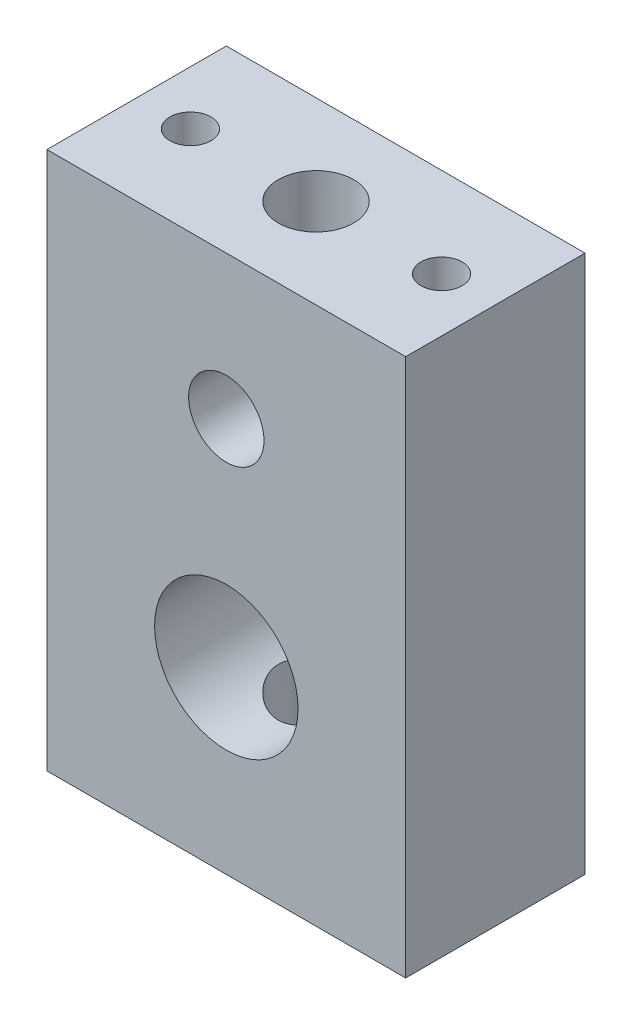
ISO-10303-21;
HEADER;
FILE_DESCRIPTION(('STEP AP214'),'2;1');
FILE_NAME('part.step','',(''),(''),'','','');
FILE_SCHEMA(('AUTOMOTIVE_DESIGN { 1 0 10303 214 1 1 1 1 }'));
ENDSEC;
DATA;
#1=APPLICATION_CONTEXT('core data for automotive mechanical design processes');
#2=APPLICATION_PROTOCOL_DEFINITION('international standard','automotive_design',2000,#1);
#3=PRODUCT_CONTEXT('',#1,'mechanical');
#4=PRODUCT('Part','Part','',(#3));
#5=PRODUCT_RELATED_PRODUCT_CATEGORY('part','',(#4));
#6=PRODUCT_DEFINITION_FORMATION('','',#4);
#7=PRODUCT_DEFINITION_CONTEXT('part definition',#1,'design');
#8=PRODUCT_DEFINITION('design','',#6,#7);
#9=PRODUCT_DEFINITION_SHAPE('','',#8);
#10=(LENGTH_UNIT() NAMED_UNIT(*) SI_UNIT(.MILLI.,.METRE.));
#11=(NAMED_UNIT(*) PLANE_ANGLE_UNIT() SI_UNIT($,.RADIAN.));
#12=(NAMED_UNIT(*) SI_UNIT($,.STERADIAN.) SOLID_ANGLE_UNIT());
#13=UNCERTAINTY_MEASURE_WITH_UNIT(LENGTH_MEASURE(1.E-05),#10,'distance_accuracy_value','');
#14=(GEOMETRIC_REPRESENTATION_CONTEXT(3) GLOBAL_UNCERTAINTY_ASSIGNED_CONTEXT((#13)) GLOBAL_UNIT_ASSIGNED_CONTEXT((#10,
#11,#12)) REPRESENTATION_CONTEXT('',''));
#15=CARTESIAN_POINT('',(0.,0.,0.));
#16=DIRECTION('',(0.,0.,1.));
#17=DIRECTION('',(1.,0.,0.));
#18=AXIS2_PLACEMENT_3D('',#15,#16,#17);
#19=CARTESIAN_POINT('',(10.,22.,10.));
#20=DIRECTION('',(0.,0.,-1.));
#21=DIRECTION('',(-1.,0.,0.));
#22=AXIS2_PLACEMENT_3D('',#19,#20,#21);
#23=CYLINDRICAL_SURFACE('',#22,2.1);
#24=CARTESIAN_POINT('',(10.,22.,5.));
#25=DIRECTION('',(0.,0.707106781186547,-0.707106781186547));
#26=DIRECTION('',(0.,-0.707106781186547,-0.707106781186547));
#27=AXIS2_PLACEMENT_3D('',#24,#25,#26);
#28=ELLIPSE('',#27,2.9698484809835,2.1);
#29=CARTESIAN_POINT('',(12.1,22.,5.));
#30=VERTEX_POINT('',#29);
#31=CARTESIAN_POINT('',(7.9,22.,5.));
#32=VERTEX_POINT('',#31);
#33=EDGE_CURVE('E11',#30,#32,#28,.F.);
#34=ORIENTED_EDGE('',*,*,#33,.F.);
#35=CARTESIAN_POINT('',(10.,22.,5.));
#36=DIRECTION('',(0.,-0.707106781186547,-0.707106781186547));
#37=DIRECTION('',(0.,0.707106781186547,-0.707106781186547));
#38=AXIS2_PLACEMENT_3D('',#35,#36,#37);
#39=ELLIPSE('',#38,2.9698484809835,2.1);
#40=EDGE_CURVE('E48',#32,#30,#39,.F.);
#41=ORIENTED_EDGE('',*,*,#40,.F.);
#42=EDGE_LOOP('',(#34,#41));
#43=FACE_BOUND('',#42,.T.);
#44=CARTESIAN_POINT('',(10.,22.,10.));
#45=DIRECTION('',(0.,0.,1.));
#46=DIRECTION('',(1.,0.,0.));
#47=AXIS2_PLACEMENT_3D('',#44,#45,#46);
#48=CIRCLE('',#47,2.1);
#49=CARTESIAN_POINT('',(12.1,22.,10.));
#50=VERTEX_POINT('',#49);
#51=EDGE_CURVE('E131',#50,#50,#48,.T.);
#52=ORIENTED_EDGE('',*,*,#51,.T.);
#53=EDGE_LOOP('',(#52));
#54=FACE_BOUND('',#53,.T.);
#55=ADVANCED_FACE('F34',(#43,#54),#23,.F.);
#56=CARTESIAN_POINT('',(0.,0.,10.));
#57=DIRECTION('',(0.,0.,-1.));
#58=DIRECTION('',(-1.,0.,0.));
#59=AXIS2_PLACEMENT_3D('',#56,#57,#58);
#60=PLANE('',#59);
#61=CARTESIAN_POINT('',(10.,10.,10.));
#62=DIRECTION('',(0.,0.,1.));
#63=DIRECTION('',(1.,0.,0.));
#64=AXIS2_PLACEMENT_3D('',#61,#62,#63);
#65=CIRCLE('',#64,4.);
#66=CARTESIAN_POINT('',(14.,10.,10.));
#67=VERTEX_POINT('',#66);
#68=EDGE_CURVE('E122',#67,#67,#65,.T.);
#69=ORIENTED_EDGE('',*,*,#68,.F.);
#70=EDGE_LOOP('',(#69));
#71=FACE_BOUND('',#70,.T.);
#72=DIRECTION('',(0.,-1.,0.));
#73=VECTOR('',#72,1.);
#74=CARTESIAN_POINT('',(0.,0.,10.));
#75=LINE('',#74,#73);
#76=CARTESIAN_POINT('',(0.,30.,10.));
#77=VERTEX_POINT('',#76);
#78=CARTESIAN_POINT('',(0.,0.,10.));
#79=VERTEX_POINT('',#78);
#80=EDGE_CURVE('E114',#77,#79,#75,.T.);
#81=ORIENTED_EDGE('',*,*,#80,.T.);
#82=DIRECTION('',(1.,0.,0.));
#83=VECTOR('',#82,1.);
#84=CARTESIAN_POINT('',(0.,0.,10.));
#85=LINE('',#84,#83);
#86=CARTESIAN_POINT('',(20.,0.,10.));
#87=VERTEX_POINT('',#86);
#88=EDGE_CURVE('E86',#79,#87,#85,.T.);
#89=ORIENTED_EDGE('',*,*,#88,.T.);
#90=DIRECTION('',(0.,1.,0.));
#91=VECTOR('',#90,1.);
#92=CARTESIAN_POINT('',(20.,0.,10.));
#93=LINE('',#92,#91);
#94=CARTESIAN_POINT('',(20.,30.,10.));
#95=VERTEX_POINT('',#94);
#96=EDGE_CURVE('E124',#87,#95,#93,.T.);
#97=ORIENTED_EDGE('',*,*,#96,.T.);
#98=DIRECTION('',(-1.,0.,0.));
#99=VECTOR('',#98,1.);
#100=CARTESIAN_POINT('',(0.,30.,10.));
#101=LINE('',#100,#99);
#102=EDGE_CURVE('E57',#95,#77,#101,.T.);
#103=ORIENTED_EDGE('',*,*,#102,.T.);
#104=EDGE_LOOP('',(#81,#89,#97,#103));
#105=FACE_BOUND('',#104,.T.);
#106=ORIENTED_EDGE('',*,*,#51,.F.);
#107=EDGE_LOOP('',(#106));
#108=FACE_BOUND('',#107,.T.);
#109=ADVANCED_FACE('F185',(#71,#105,#108),#60,.F.);
#110=CARTESIAN_POINT('',(0.,0.,0.));
#111=DIRECTION('',(0.,0.,-1.));
#112=DIRECTION('',(-1.,0.,0.));
#113=AXIS2_PLACEMENT_3D('',#110,#111,#112);
#114=PLANE('',#113);
#115=CARTESIAN_POINT('',(10.,10.,0.));
#116=DIRECTION('',(0.,0.,1.));
#117=DIRECTION('',(1.,0.,0.));
#118=AXIS2_PLACEMENT_3D('',#115,#116,#117);
#119=CIRCLE('',#118,4.);
#120=CARTESIAN_POINT('',(14.,10.,0.));
#121=VERTEX_POINT('',#120);
#122=EDGE_CURVE('E128',#121,#121,#119,.T.);
#123=ORIENTED_EDGE('',*,*,#122,.T.);
#124=EDGE_LOOP('',(#123));
#125=FACE_BOUND('',#124,.T.);
#126=DIRECTION('',(0.,-1.,0.));
#127=VECTOR('',#126,1.);
#128=CARTESIAN_POINT('',(0.,0.,0.));
#129=LINE('',#128,#127);
#130=CARTESIAN_POINT('',(0.,30.,0.));
#131=VERTEX_POINT('',#130);
#132=CARTESIAN_POINT('',(0.,0.,0.));
#133=VERTEX_POINT('',#132);
#134=EDGE_CURVE('E119',#131,#133,#129,.T.);
#135=ORIENTED_EDGE('',*,*,#134,.F.);
#136=DIRECTION('',(-1.,0.,0.));
#137=VECTOR('',#136,1.);
#138=CARTESIAN_POINT('',(0.,30.,0.));
#139=LINE('',#138,#137);
#140=CARTESIAN_POINT('',(20.,30.,0.));
#141=VERTEX_POINT('',#140);
#142=EDGE_CURVE('E78',#141,#131,#139,.T.);
#143=ORIENTED_EDGE('',*,*,#142,.F.);
#144=DIRECTION('',(0.,1.,0.));
#145=VECTOR('',#144,1.);
#146=CARTESIAN_POINT('',(20.,0.,0.));
#147=LINE('',#146,#145);
#148=CARTESIAN_POINT('',(20.,0.,0.));
#149=VERTEX_POINT('',#148);
#150=EDGE_CURVE('E115',#149,#141,#147,.T.);
#151=ORIENTED_EDGE('',*,*,#150,.F.);
#152=DIRECTION('',(1.,0.,0.));
#153=VECTOR('',#152,1.);
#154=CARTESIAN_POINT('',(0.,0.,0.));
#155=LINE('',#154,#153);
#156=EDGE_CURVE('E117',#133,#149,#155,.T.);
#157=ORIENTED_EDGE('',*,*,#156,.F.);
#158=EDGE_LOOP('',(#135,#143,#151,#157));
#159=FACE_BOUND('',#158,.T.);
#160=CARTESIAN_POINT('',(10.,22.,0.));
#161=DIRECTION('',(0.,0.,1.));
#162=DIRECTION('',(1.,0.,0.));
#163=AXIS2_PLACEMENT_3D('',#160,#161,#162);
#164=CIRCLE('',#163,2.1);
#165=CARTESIAN_POINT('',(12.1,22.,0.));
#166=VERTEX_POINT('',#165);
#167=EDGE_CURVE('E134',#166,#166,#164,.T.);
#168=ORIENTED_EDGE('',*,*,#167,.T.);
#169=EDGE_LOOP('',(#168));
#170=FACE_BOUND('',#169,.T.);
#171=ADVANCED_FACE('F189',(#125,#159,#170),#114,.T.);
#172=CARTESIAN_POINT('',(0.,0.,10.));
#173=DIRECTION('',(1.,0.,0.));
#174=DIRECTION('',(0.,0.,-1.));
#175=AXIS2_PLACEMENT_3D('',#172,#173,#174);
#176=PLANE('',#175);
#177=ORIENTED_EDGE('',*,*,#134,.T.);
#178=DIRECTION('',(0.,0.,-1.));
#179=VECTOR('',#178,1.);
#180=CARTESIAN_POINT('',(0.,0.,10.));
#181=LINE('',#180,#179);
#182=EDGE_CURVE('E99',#79,#133,#181,.T.);
#183=ORIENTED_EDGE('',*,*,#182,.F.);
#184=ORIENTED_EDGE('',*,*,#80,.F.);
#185=DIRECTION('',(0.,0.,-1.));
#186=VECTOR('',#185,1.);
#187=CARTESIAN_POINT('',(0.,30.,10.));
#188=LINE('',#187,#186);
#189=EDGE_CURVE('E111',#77,#131,#188,.T.);
#190=ORIENTED_EDGE('',*,*,#189,.T.);
#191=EDGE_LOOP('',(#177,#183,#184,#190));
#192=FACE_BOUND('',#191,.T.);
#193=ADVANCED_FACE('F36',(#192),#176,.F.);
#194=CARTESIAN_POINT('',(0.,0.,10.));
#195=DIRECTION('',(0.,1.,0.));
#196=DIRECTION('',(0.,0.,1.));
#197=AXIS2_PLACEMENT_3D('',#194,#195,#196);
#198=PLANE('',#197);
#199=CARTESIAN_POINT('',(10.,0.,5.));
#200=DIRECTION('',(0.,1.,0.));
#201=DIRECTION('',(0.,0.,1.));
#202=AXIS2_PLACEMENT_3D('',#199,#200,#201);
#203=CIRCLE('',#202,2.1);
#204=CARTESIAN_POINT('',(10.,0.,7.1));
#205=VERTEX_POINT('',#204);
#206=EDGE_CURVE('E214',#205,#205,#203,.T.);
#207=ORIENTED_EDGE('',*,*,#206,.T.);
#208=EDGE_LOOP('',(#207));
#209=FACE_BOUND('',#208,.T.);
#210=CARTESIAN_POINT('',(17.,0.,5.));
#211=DIRECTION('',(0.,1.,0.));
#212=DIRECTION('',(0.,0.,1.));
#213=AXIS2_PLACEMENT_3D('',#210,#211,#212);
#214=CIRCLE('',#213,1.15);
#215=CARTESIAN_POINT('',(17.,0.,6.15));
#216=VERTEX_POINT('',#215);
#217=EDGE_CURVE('E143',#216,#216,#214,.T.);
#218=ORIENTED_EDGE('',*,*,#217,.T.);
#219=EDGE_LOOP('',(#218));
#220=FACE_BOUND('',#219,.T.);
#221=CARTESIAN_POINT('',(3.,0.,5.));
#222=DIRECTION('',(0.,1.,0.));
#223=DIRECTION('',(0.,0.,1.));
#224=AXIS2_PLACEMENT_3D('',#221,#222,#223);
#225=CIRCLE('',#224,1.15);
#226=CARTESIAN_POINT('',(3.,0.,6.15));
#227=VERTEX_POINT('',#226);
#228=EDGE_CURVE('E137',#227,#227,#225,.T.);
#229=ORIENTED_EDGE('',*,*,#228,.T.);
#230=EDGE_LOOP('',(#229));
#231=FACE_BOUND('',#230,.T.);
#232=ORIENTED_EDGE('',*,*,#156,.T.);
#233=DIRECTION('',(0.,0.,-1.));
#234=VECTOR('',#233,1.);
#235=CARTESIAN_POINT('',(20.,0.,10.));
#236=LINE('',#235,#234);
#237=EDGE_CURVE('E106',#87,#149,#236,.T.);
#238=ORIENTED_EDGE('',*,*,#237,.F.);
#239=ORIENTED_EDGE('',*,*,#88,.F.);
#240=ORIENTED_EDGE('',*,*,#182,.T.);
#241=EDGE_LOOP('',(#232,#238,#239,#240));
#242=FACE_BOUND('',#241,.T.);
#243=ADVANCED_FACE('F203',(#209,#220,#231,#242),#198,.F.);
#244=CARTESIAN_POINT('',(20.,0.,10.));
#245=DIRECTION('',(-1.,0.,0.));
#246=DIRECTION('',(0.,0.,1.));
#247=AXIS2_PLACEMENT_3D('',#244,#245,#246);
#248=PLANE('',#247);
#249=ORIENTED_EDGE('',*,*,#150,.T.);
#250=DIRECTION('',(0.,0.,-1.));
#251=VECTOR('',#250,1.);
#252=CARTESIAN_POINT('',(20.,30.,10.));
#253=LINE('',#252,#251);
#254=EDGE_CURVE('E109',#95,#141,#253,.T.);
#255=ORIENTED_EDGE('',*,*,#254,.F.);
#256=ORIENTED_EDGE('',*,*,#96,.F.);
#257=ORIENTED_EDGE('',*,*,#237,.T.);
#258=EDGE_LOOP('',(#249,#255,#256,#257));
#259=FACE_BOUND('',#258,.T.);
#260=ADVANCED_FACE('F200',(#259),#248,.F.);
#261=CARTESIAN_POINT('',(0.,30.,10.));
#262=DIRECTION('',(0.,-1.,0.));
#263=DIRECTION('',(0.,0.,-1.));
#264=AXIS2_PLACEMENT_3D('',#261,#262,#263);
#265=PLANE('',#264);
#266=CARTESIAN_POINT('',(10.,30.,5.));
#267=DIRECTION('',(0.,1.,0.));
#268=DIRECTION('',(0.,0.,1.));
#269=AXIS2_PLACEMENT_3D('',#266,#267,#268);
#270=CIRCLE('',#269,2.1);
#271=CARTESIAN_POINT('',(10.,30.,7.1));
#272=VERTEX_POINT('',#271);
#273=EDGE_CURVE('E236',#272,#272,#270,.T.);
#274=ORIENTED_EDGE('',*,*,#273,.F.);
#275=EDGE_LOOP('',(#274));
#276=FACE_BOUND('',#275,.T.);
#277=CARTESIAN_POINT('',(17.,30.,5.));
#278=DIRECTION('',(0.,1.,0.));
#279=DIRECTION('',(0.,0.,1.));
#280=AXIS2_PLACEMENT_3D('',#277,#278,#279);
#281=CIRCLE('',#280,1.15);
#282=CARTESIAN_POINT('',(17.,30.,6.15));
#283=VERTEX_POINT('',#282);
#284=EDGE_CURVE('E146',#283,#283,#281,.T.);
#285=ORIENTED_EDGE('',*,*,#284,.F.);
#286=EDGE_LOOP('',(#285));
#287=FACE_BOUND('',#286,.T.);
#288=CARTESIAN_POINT('',(3.,30.,5.));
#289=DIRECTION('',(0.,1.,0.));
#290=DIRECTION('',(0.,0.,1.));
#291=AXIS2_PLACEMENT_3D('',#288,#289,#290);
#292=CIRCLE('',#291,1.15);
#293=CARTESIAN_POINT('',(3.,30.,6.15));
#294=VERTEX_POINT('',#293);
#295=EDGE_CURVE('E140',#294,#294,#292,.T.);
#296=ORIENTED_EDGE('',*,*,#295,.F.);
#297=EDGE_LOOP('',(#296));
#298=FACE_BOUND('',#297,.T.);
#299=ORIENTED_EDGE('',*,*,#142,.T.);
#300=ORIENTED_EDGE('',*,*,#189,.F.);
#301=ORIENTED_EDGE('',*,*,#102,.F.);
#302=ORIENTED_EDGE('',*,*,#254,.T.);
#303=EDGE_LOOP('',(#299,#300,#301,#302));
#304=FACE_BOUND('',#303,.T.);
#305=ADVANCED_FACE('F182',(#276,#287,#298,#304),#265,.F.);
#306=CARTESIAN_POINT('',(10.,10.,10.));
#307=DIRECTION('',(0.,0.,-1.));
#308=DIRECTION('',(-1.,0.,0.));
#309=AXIS2_PLACEMENT_3D('',#306,#307,#308);
#310=CYLINDRICAL_SURFACE('',#309,4.);
#311=CARTESIAN_POINT('',(10.,6.,7.1));
#312=CARTESIAN_POINT('',(10.1097252395222,6.00000735712143,7.09999149182402));
#313=CARTESIAN_POINT('',(10.219566121798,6.00456264372183,7.09134922217853));
#314=CARTESIAN_POINT('',(10.4359563328533,6.02233943440273,7.05717948516372));
#315=CARTESIAN_POINT('',(10.5424999670262,6.03557514127012,7.03162434455593));
#316=CARTESIAN_POINT('',(10.7488477672566,6.06933643737892,6.96492682041999));
#317=CARTESIAN_POINT('',(10.848677088492,6.08983277838819,6.92384693196483));
#318=CARTESIAN_POINT('',(11.0398542926017,6.13627185166547,6.82761268027));
#319=CARTESIAN_POINT('',(11.1312023073436,6.1622144992337,6.77245853590725));
#320=CARTESIAN_POINT('',(11.309471828917,6.21918036989897,6.64560480379001));
#321=CARTESIAN_POINT('',(11.395724279159,6.2504237366637,6.57306544943579));
#322=CARTESIAN_POINT('',(11.5554650500713,6.31381930334756,6.41532568390628));
#323=CARTESIAN_POINT('',(11.6289425654236,6.34597224613962,6.33011466668524));
#324=CARTESIAN_POINT('',(11.7675321072039,6.41082397725215,6.14052416418153));
#325=CARTESIAN_POINT('',(11.831345969498,6.44332348866761,6.03511911137416));
#326=CARTESIAN_POINT('',(11.940078009522,6.50144007791784,5.81322101259495));
#327=CARTESIAN_POINT('',(11.9850105598362,6.52706238534034,5.69673648353417));
#328=CARTESIAN_POINT('',(12.0516277897332,6.56601687704523,5.4632691019904));
#329=CARTESIAN_POINT('',(12.0745813337518,6.58001266877583,5.34676509569801));
#330=CARTESIAN_POINT('',(12.1004206577409,6.59581278015183,5.11079196134465));
#331=CARTESIAN_POINT('',(12.1033302560727,6.59763156974199,4.99132652193647));
#332=CARTESIAN_POINT('',(12.0899257568675,6.58939436861611,4.77023585900601));
#333=CARTESIAN_POINT('',(12.0761575200203,6.5809106035025,4.66838235315366));
#334=CARTESIAN_POINT('',(12.0342448200542,6.55581083424707,4.46871985136041));
#335=CARTESIAN_POINT('',(12.0060949114543,6.53919174984499,4.37091240259461));
#336=CARTESIAN_POINT('',(11.9357620172503,6.49935982662121,4.17933944133552));
#337=CARTESIAN_POINT('',(11.8932738651597,6.47600536005699,4.08571682638858));
#338=CARTESIAN_POINT('',(11.795716667553,6.42530822285814,3.9064612544599));
#339=CARTESIAN_POINT('',(11.7406420030435,6.39796377295332,3.82083189002303));
#340=CARTESIAN_POINT('',(11.6103939818052,6.33769555595972,3.64721957759017));
#341=CARTESIAN_POINT('',(11.5334784250171,6.30453027169095,3.5606227305343));
#342=CARTESIAN_POINT('',(11.3661646278118,6.23946073012832,3.40094507949334));
#343=CARTESIAN_POINT('',(11.2757586855825,6.20755720643636,3.32787205014572));
#344=CARTESIAN_POINT('',(11.07766804033,6.14643646739299,3.19341787931535));
#345=CARTESIAN_POINT('',(10.9692989194435,6.11747001525525,3.13292153118831));
#346=CARTESIAN_POINT('',(10.7420234421849,6.06771227404274,3.03153732928501));
#347=CARTESIAN_POINT('',(10.6231263407839,6.04691389029545,2.99063245181349));
#348=CARTESIAN_POINT('',(10.3893969746267,6.0174126557382,2.93322732089385));
#349=CARTESIAN_POINT('',(10.2751308230942,6.00780492271699,2.9148930907168));
#350=CARTESIAN_POINT('',(10.0447608666751,5.99859330232608,2.89730685099086));
#351=CARTESIAN_POINT('',(9.9286581079261,5.99898391135607,2.89804434338993));
#352=CARTESIAN_POINT('',(9.70872092144702,6.0092327131638,2.91762725788288));
#353=CARTESIAN_POINT('',(9.60470032451397,6.01826140500287,2.93488622954968));
#354=CARTESIAN_POINT('',(9.40127181780377,6.04373452472691,2.98443875043909));
#355=CARTESIAN_POINT('',(9.30186439595728,6.06017973508651,3.01673388605335));
#356=CARTESIAN_POINT('',(9.10744667267227,6.09955778917673,3.09614425381873));
#357=CARTESIAN_POINT('',(9.01261796662089,6.12264823611772,3.14362307426731));
#358=CARTESIAN_POINT('',(8.83198843397269,6.17317896967193,3.25161917503482));
#359=CARTESIAN_POINT('',(8.74619124866934,6.20062099964834,3.312141684517));
#360=CARTESIAN_POINT('',(8.57644597835234,6.26069150054948,3.45183455389137));
#361=CARTESIAN_POINT('',(8.49364624763825,6.29356175470312,3.53229813881506));
#362=CARTESIAN_POINT('',(8.34215054537142,6.35879793581409,3.70585137885724));
#363=CARTESIAN_POINT('',(8.27346680544534,6.39116340311868,3.79895186895899));
#364=CARTESIAN_POINT('',(8.14802592286797,6.45381708724124,4.00233559015911));
#365=CARTESIAN_POINT('',(8.09227941578299,6.48384996522084,4.11332823562711));
#366=CARTESIAN_POINT('',(8.00083622566024,6.53501441698331,4.34516122596433));
#367=CARTESIAN_POINT('',(7.96511152583645,6.55615841867861,4.46598753776113));
#368=CARTESIAN_POINT('',(7.9182077120598,6.58432664261803,4.70149049526115));
#369=CARTESIAN_POINT('',(7.90496787202061,6.59253060297121,4.81561103123257));
#370=CARTESIAN_POINT('',(7.89735597501305,6.59721867481627,5.04469308443813));
#371=CARTESIAN_POINT('',(7.90297244647974,6.59370991195439,5.1596540479175));
#372=CARTESIAN_POINT('',(7.93094268033588,6.57666719939133,5.37316961432223));
#373=CARTESIAN_POINT('',(7.95130413421546,6.5643284893851,5.47209433551285));
#374=CARTESIAN_POINT('',(8.00554046552531,6.5325639201564,5.66496081401225));
#375=CARTESIAN_POINT('',(8.03942014323663,6.51313554362409,5.75890078781238));
#376=CARTESIAN_POINT('',(8.12217291990849,6.46784460498247,5.94599660125697));
#377=CARTESIAN_POINT('',(8.17188302793889,6.44164384863016,6.03869769157733));
#378=CARTESIAN_POINT('',(8.28402810851478,6.38622716980778,6.21506230921822));
#379=CARTESIAN_POINT('',(8.34646992511578,6.35700962982328,6.29872093850826));
#380=CARTESIAN_POINT('',(8.49243500638422,6.2940053933876,6.46672364713411));
#381=CARTESIAN_POINT('',(8.57768101319548,6.26014701561832,6.54955350976633));
#382=CARTESIAN_POINT('',(8.7616087291921,6.19527738709219,6.70015739194561));
#383=CARTESIAN_POINT('',(8.86029865553675,6.16426789718714,6.76792213623383));
#384=CARTESIAN_POINT('',(9.07127741358921,6.10775536569268,6.88743364904118));
#385=CARTESIAN_POINT('',(9.18379352536369,6.08237123529014,6.93884301060636));
#386=CARTESIAN_POINT('',(9.35889820048832,6.05126254272285,7.00070791315573));
#387=CARTESIAN_POINT('',(9.41828167895052,6.04205787823116,7.01878135698884));
#388=CARTESIAN_POINT('',(9.53872715481944,6.02622292348595,7.04965439112677));
#389=CARTESIAN_POINT('',(9.59978817571371,6.01959116815001,7.06245698304871));
#390=CARTESIAN_POINT('',(9.71722282280003,6.00961465038475,7.08164251076547));
#391=CARTESIAN_POINT('',(9.77349525398962,6.00601882824931,7.08851710911178));
#392=CARTESIAN_POINT('',(9.8865014673951,6.00120957667597,7.09769809925703));
#393=CARTESIAN_POINT('',(9.94323525862547,5.99999619390127,7.1000044015799));
#394=CARTESIAN_POINT('',(10.,6.,7.1));
#395=B_SPLINE_CURVE_WITH_KNOTS('',3,(#311,#312,#313,#314,#315,#316,#317,#318,#319,#320,#321,
#322,#323,#324,#325,#326,#327,#328,#329,#330,#331,#332,#333,#334,#335,#336,#337,#338,#339,#340,
#341,#342,#343,#344,#345,#346,#347,#348,#349,#350,#351,#352,#353,#354,#355,#356,#357,#358,#359,
#360,#361,#362,#363,#364,#365,#366,#367,#368,#369,#370,#371,#372,#373,#374,#375,#376,#377,#378,
#379,#380,#381,#382,#383,#384,#385,#386,#387,#388,#389,#390,#391,#392,#393,#394),.UNSPECIFIED.,
.T.,.F.,(4,2,2,2,2,2,2,2,2,2,2,2,2,2,2,2,2,2,2,2,2,2,2,2,2,2,2,2,2,2,2,2,2,2,2,2,2,2,2,2,2,4),
(0.,0.328955388056856,0.658450355809533,0.986632826787796,1.31481019432105,1.6642261012777,
2.01393612903032,2.3943054227538,2.77438464995628,3.13089429519635,3.48698022433372,
3.79492330354659,4.10298306894291,4.41806287071792,4.73328360921356,5.0931748825876,
5.4532724136417,5.83355153918037,6.21349962504739,6.55994297045685,6.90619561978194,
7.22222027001752,7.53827827001649,7.86255611827312,8.18696421086294,8.54557019619715,
8.90448561862087,9.28577946390602,9.66653841880978,10.0100186118085,10.3532898805348,
10.6572136356427,10.9612454093544,11.2851996834104,11.6093285635883,11.9784125341219,
12.3477231159961,12.7242211787441,12.9122308814787,13.1001333688401,13.270310275105,
13.4404905144749),.UNSPECIFIED.);
#396=CARTESIAN_POINT('',(10.,6.,7.1));
#397=VERTEX_POINT('',#396);
#398=EDGE_CURVE('E149',#397,#397,#395,.T.);
#399=ORIENTED_EDGE('',*,*,#398,.F.);
#400=EDGE_LOOP('',(#399));
#401=FACE_BOUND('',#400,.T.);
#402=CARTESIAN_POINT('',(10.,14.,7.1));
#403=CARTESIAN_POINT('',(9.89027476047782,13.9999926428786,7.09999149182402));
#404=CARTESIAN_POINT('',(9.78043387820201,13.9954373562782,7.09134922217853));
#405=CARTESIAN_POINT('',(9.5640436671467,13.9776605655973,7.05717948516372));
#406=CARTESIAN_POINT('',(9.45750003297383,13.9644248587299,7.03162434455593));
#407=CARTESIAN_POINT('',(9.25115223274336,13.9306635626211,6.96492682041999));
#408=CARTESIAN_POINT('',(9.15132291150798,13.9101672216118,6.92384693196483));
#409=CARTESIAN_POINT('',(8.9601457073983,13.8637281483345,6.82761268027));
#410=CARTESIAN_POINT('',(8.86879769265641,13.8377855007663,6.77245853590725));
#411=CARTESIAN_POINT('',(8.69052817108305,13.780819630101,6.64560480379001));
#412=CARTESIAN_POINT('',(8.60427572084104,13.7495762633363,6.57306544943579));
#413=CARTESIAN_POINT('',(8.44453494992871,13.6861806966524,6.41532568390628));
#414=CARTESIAN_POINT('',(8.37105743457642,13.6540277538604,6.33011466668524));
#415=CARTESIAN_POINT('',(8.23246789279614,13.5891760227479,6.14052416418153));
#416=CARTESIAN_POINT('',(8.16865403050204,13.5566765113324,6.03511911137416));
#417=CARTESIAN_POINT('',(8.059921990478,13.4985599220822,5.81322101259495));
#418=CARTESIAN_POINT('',(8.01498944016383,13.4729376146597,5.69673648353417));
#419=CARTESIAN_POINT('',(7.94837221026677,13.4339831229548,5.4632691019904));
#420=CARTESIAN_POINT('',(7.92541866624817,13.4199873312242,5.34676509569801));
#421=CARTESIAN_POINT('',(7.8995793422591,13.4041872198482,5.11079196134465));
#422=CARTESIAN_POINT('',(7.89666974392728,13.402368430258,4.99132652193647));
#423=CARTESIAN_POINT('',(7.91007424313252,13.4106056313839,4.77023585900601));
#424=CARTESIAN_POINT('',(7.92384247997974,13.4190893964975,4.66838235315366));
#425=CARTESIAN_POINT('',(7.96575517994578,13.4441891657529,4.46871985136041));
#426=CARTESIAN_POINT('',(7.99390508854568,13.460808250155,4.37091240259461));
#427=CARTESIAN_POINT('',(8.06423798274965,13.5006401733788,4.17933944133552));
#428=CARTESIAN_POINT('',(8.10672613484034,13.523994639943,4.08571682638858));
#429=CARTESIAN_POINT('',(8.20428333244703,13.5746917771419,3.9064612544599));
#430=CARTESIAN_POINT('',(8.25935799695647,13.6020362270467,3.82083189002303));
#431=CARTESIAN_POINT('',(8.38960601819478,13.6623044440403,3.64721957759017));
#432=CARTESIAN_POINT('',(8.46652157498293,13.6954697283091,3.5606227305343));
#433=CARTESIAN_POINT('',(8.63383537218825,13.7605392698717,3.40094507949334));
#434=CARTESIAN_POINT('',(8.72424131441753,13.7924427935636,3.32787205014572));
#435=CARTESIAN_POINT('',(8.92233195967002,13.853563532607,3.19341787931535));
#436=CARTESIAN_POINT('',(9.0307010805565,13.8825299847447,3.13292153118831));
#437=CARTESIAN_POINT('',(9.25797655781514,13.9322877259573,3.03153732928501));
#438=CARTESIAN_POINT('',(9.37687365921613,13.9530861097046,2.99063245181349));
#439=CARTESIAN_POINT('',(9.61060302537331,13.9825873442618,2.93322732089385));
#440=CARTESIAN_POINT('',(9.72486917690578,13.992195077283,2.9148930907168));
#441=CARTESIAN_POINT('',(9.95523913332491,14.0014066976739,2.89730685099086));
#442=CARTESIAN_POINT('',(10.0713418920739,14.0010160886439,2.89804434338993));
#443=CARTESIAN_POINT('',(10.291279078553,13.9907672868362,2.91762725788288));
#444=CARTESIAN_POINT('',(10.395299675486,13.9817385949971,2.93488622954967));
#445=CARTESIAN_POINT('',(10.5987281821962,13.9562654752731,2.98443875043909));
#446=CARTESIAN_POINT('',(10.6981356040427,13.9398202649135,3.01673388605335));
#447=CARTESIAN_POINT('',(10.8925533273277,13.9004422108233,3.09614425381873));
#448=CARTESIAN_POINT('',(10.9873820333791,13.8773517638823,3.14362307426731));
#449=CARTESIAN_POINT('',(11.1680115660273,13.8268210303281,3.25161917503482));
#450=CARTESIAN_POINT('',(11.2538087513307,13.7993790003517,3.312141684517));
#451=CARTESIAN_POINT('',(11.4235540216477,13.7393084994505,3.45183455389137));
#452=CARTESIAN_POINT('',(11.5063537523618,13.7064382452969,3.53229813881506));
#453=CARTESIAN_POINT('',(11.6578494546286,13.6412020641859,3.70585137885724));
#454=CARTESIAN_POINT('',(11.7265331945547,13.6088365968813,3.79895186895899));
#455=CARTESIAN_POINT('',(11.851974077132,13.5461829127588,4.00233559015911));
#456=CARTESIAN_POINT('',(11.907720584217,13.5161500347792,4.1133282356271));
#457=CARTESIAN_POINT('',(11.9991637743398,13.4649855830167,4.34516122596433));
#458=CARTESIAN_POINT('',(12.0348884741635,13.4438415813214,4.46598753776113));
#459=CARTESIAN_POINT('',(12.0817922879402,13.415673357382,4.70149049526115));
#460=CARTESIAN_POINT('',(12.0950321279794,13.4074693970288,4.81561103123257));
#461=CARTESIAN_POINT('',(12.1026440249869,13.4027813251837,5.04469308443813));
#462=CARTESIAN_POINT('',(12.0970275535203,13.4062900880456,5.1596540479175));
#463=CARTESIAN_POINT('',(12.0690573196641,13.4233328006087,5.37316961432223));
#464=CARTESIAN_POINT('',(12.0486958657845,13.4356715106149,5.47209433551285));
#465=CARTESIAN_POINT('',(11.9944595344747,13.4674360798436,5.66496081401225));
#466=CARTESIAN_POINT('',(11.9605798567634,13.4868644563759,5.75890078781238));
#467=CARTESIAN_POINT('',(11.8778270800915,13.5321553950175,5.94599660125697));
#468=CARTESIAN_POINT('',(11.8281169720611,13.5583561513698,6.03869769157733));
#469=CARTESIAN_POINT('',(11.7159718914852,13.6137728301922,6.21506230921822));
#470=CARTESIAN_POINT('',(11.6535300748842,13.6429903701767,6.29872093850826));
#471=CARTESIAN_POINT('',(11.5075649936158,13.7059946066124,6.46672364713411));
#472=CARTESIAN_POINT('',(11.4223189868045,13.7398529843817,6.54955350976633));
#473=CARTESIAN_POINT('',(11.2383912708079,13.8047226129078,6.70015739194561));
#474=CARTESIAN_POINT('',(11.1397013444633,13.8357321028129,6.76792213623383));
#475=CARTESIAN_POINT('',(10.9287225864108,13.8922446343073,6.88743364904118));
#476=CARTESIAN_POINT('',(10.8162064746363,13.9176287647099,6.93884301060636));
#477=CARTESIAN_POINT('',(10.6411017995117,13.9487374572772,7.00070791315573));
#478=CARTESIAN_POINT('',(10.5817183210495,13.9579421217688,7.01878135698884));
#479=CARTESIAN_POINT('',(10.4612728451806,13.973777076514,7.04965439112677));
#480=CARTESIAN_POINT('',(10.4002118242863,13.98040883185,7.06245698304871));
#481=CARTESIAN_POINT('',(10.2827771772,13.9903853496153,7.08164251076547));
#482=CARTESIAN_POINT('',(10.2265047460104,13.9939811717507,7.08851710911178));
#483=CARTESIAN_POINT('',(10.1134985326049,13.998790423324,7.09769809925703));
#484=CARTESIAN_POINT('',(10.0567647413745,14.0000038060987,7.1000044015799));
#485=CARTESIAN_POINT('',(10.,14.,7.1));
#486=B_SPLINE_CURVE_WITH_KNOTS('',3,(#402,#403,#404,#405,#406,#407,#408,#409,#410,#411,#412,
#413,#414,#415,#416,#417,#418,#419,#420,#421,#422,#423,#424,#425,#426,#427,#428,#429,#430,#431,
#432,#433,#434,#435,#436,#437,#438,#439,#440,#441,#442,#443,#444,#445,#446,#447,#448,#449,#450,
#451,#452,#453,#454,#455,#456,#457,#458,#459,#460,#461,#462,#463,#464,#465,#466,#467,#468,#469,
#470,#471,#472,#473,#474,#475,#476,#477,#478,#479,#480,#481,#482,#483,#484,#485),.UNSPECIFIED.,
.T.,.F.,(4,2,2,2,2,2,2,2,2,2,2,2,2,2,2,2,2,2,2,2,2,2,2,2,2,2,2,2,2,2,2,2,2,2,2,2,2,2,2,2,2,4),
(0.,0.328955388056856,0.658450355809533,0.986632826787796,1.31481019432105,1.66422610127769,
2.01393612903032,2.3943054227538,2.77438464995628,3.13089429519635,3.48698022433372,
3.79492330354659,4.10298306894291,4.41806287071792,4.73328360921357,5.09317488258761,
5.4532724136417,5.83355153918037,6.21349962504739,6.55994297045685,6.90619561978194,
7.22222027001752,7.53827827001649,7.86255611827312,8.18696421086294,8.54557019619715,
8.90448561862086,9.28577946390602,9.66653841880978,10.0100186118085,10.3532898805348,
10.6572136356427,10.9612454093544,11.2851996834104,11.6093285635883,11.9784125341219,
12.3477231159961,12.7242211787441,12.9122308814787,13.1001333688401,13.270310275105,
13.4404905144749),.UNSPECIFIED.);
#487=CARTESIAN_POINT('',(10.,14.,7.1));
#488=VERTEX_POINT('',#487);
#489=EDGE_CURVE('E158',#488,#488,#486,.T.);
#490=ORIENTED_EDGE('',*,*,#489,.F.);
#491=EDGE_LOOP('',(#490));
#492=FACE_BOUND('',#491,.T.);
#493=ORIENTED_EDGE('',*,*,#68,.T.);
#494=EDGE_LOOP('',(#493));
#495=FACE_BOUND('',#494,.T.);
#496=ORIENTED_EDGE('',*,*,#122,.F.);
#497=EDGE_LOOP('',(#496));
#498=FACE_BOUND('',#497,.T.);
#499=ADVANCED_FACE('F162',(#401,#492,#495,#498),#310,.F.);
#500=CARTESIAN_POINT('',(10.,22.,5.));
#501=DIRECTION('',(0.,0.707106781186547,-0.707106781186547));
#502=DIRECTION('',(0.,-0.707106781186547,-0.707106781186547));
#503=AXIS2_PLACEMENT_3D('',#500,#501,#502);
#504=ELLIPSE('',#503,2.9698484809835,2.1);
#505=EDGE_CURVE('E42',#30,#32,#504,.T.);
#506=ORIENTED_EDGE('',*,*,#505,.F.);
#507=CARTESIAN_POINT('',(10.,22.,5.));
#508=DIRECTION('',(0.,-0.707106781186547,-0.707106781186547));
#509=DIRECTION('',(0.,0.707106781186547,-0.707106781186547));
#510=AXIS2_PLACEMENT_3D('',#507,#508,#509);
#511=ELLIPSE('',#510,2.9698484809835,2.1);
#512=EDGE_CURVE('E91',#32,#30,#511,.T.);
#513=ORIENTED_EDGE('',*,*,#512,.F.);
#514=EDGE_LOOP('',(#506,#513));
#515=FACE_BOUND('',#514,.T.);
#516=ORIENTED_EDGE('',*,*,#167,.F.);
#517=EDGE_LOOP('',(#516));
#518=FACE_BOUND('',#517,.T.);
#519=ADVANCED_FACE('F102',(#515,#518),#23,.F.);
#520=CARTESIAN_POINT('',(3.,0.,5.));
#521=DIRECTION('',(0.,1.,0.));
#522=DIRECTION('',(0.,0.,1.));
#523=AXIS2_PLACEMENT_3D('',#520,#521,#522);
#524=CYLINDRICAL_SURFACE('',#523,1.15);
#525=ORIENTED_EDGE('',*,*,#228,.F.);
#526=EDGE_LOOP('',(#525));
#527=FACE_BOUND('',#526,.T.);
#528=ORIENTED_EDGE('',*,*,#295,.T.);
#529=EDGE_LOOP('',(#528));
#530=FACE_BOUND('',#529,.T.);
#531=ADVANCED_FACE('F174',(#527,#530),#524,.F.);
#532=CARTESIAN_POINT('',(17.,0.,5.));
#533=DIRECTION('',(0.,1.,0.));
#534=DIRECTION('',(0.,0.,1.));
#535=AXIS2_PLACEMENT_3D('',#532,#533,#534);
#536=CYLINDRICAL_SURFACE('',#535,1.15);
#537=ORIENTED_EDGE('',*,*,#217,.F.);
#538=EDGE_LOOP('',(#537));
#539=FACE_BOUND('',#538,.T.);
#540=ORIENTED_EDGE('',*,*,#284,.T.);
#541=EDGE_LOOP('',(#540));
#542=FACE_BOUND('',#541,.T.);
#543=ADVANCED_FACE('F170',(#539,#542),#536,.F.);
#544=CARTESIAN_POINT('',(10.,0.,5.));
#545=DIRECTION('',(0.,1.,0.));
#546=DIRECTION('',(0.,0.,1.));
#547=AXIS2_PLACEMENT_3D('',#544,#545,#546);
#548=CYLINDRICAL_SURFACE('',#547,2.1);
#549=ORIENTED_EDGE('',*,*,#489,.T.);
#550=EDGE_LOOP('',(#549));
#551=FACE_BOUND('',#550,.T.);
#552=ORIENTED_EDGE('',*,*,#505,.T.);
#553=ORIENTED_EDGE('',*,*,#40,.T.);
#554=EDGE_LOOP('',(#552,#553));
#555=FACE_BOUND('',#554,.T.);
#556=ADVANCED_FACE('F98',(#551,#555),#548,.F.);
#557=ORIENTED_EDGE('',*,*,#33,.T.);
#558=ORIENTED_EDGE('',*,*,#512,.T.);
#559=EDGE_LOOP('',(#557,#558));
#560=FACE_BOUND('',#559,.T.);
#561=ORIENTED_EDGE('',*,*,#273,.T.);
#562=EDGE_LOOP('',(#561));
#563=FACE_BOUND('',#562,.T.);
#564=ADVANCED_FACE('F92',(#560,#563),#548,.F.);
#565=ORIENTED_EDGE('',*,*,#398,.T.);
#566=EDGE_LOOP('',(#565));
#567=FACE_BOUND('',#566,.T.);
#568=ORIENTED_EDGE('',*,*,#206,.F.);
#569=EDGE_LOOP('',(#568));
#570=FACE_BOUND('',#569,.T.);
#571=ADVANCED_FACE('F169',(#567,#570),#548,.F.);
#572=CLOSED_SHELL('',(#55,#109,#171,#193,#243,#260,#305,#499,#519,#531,#543,#556,#564,#571));
#573=MANIFOLD_SOLID_BREP('B2',#572);
#574=ADVANCED_BREP_SHAPE_REPRESENTATION('',(#18,#573),#14);
#575=SHAPE_DEFINITION_REPRESENTATION(#9,#574);
ENDSEC;
END-ISO-10303-21;
